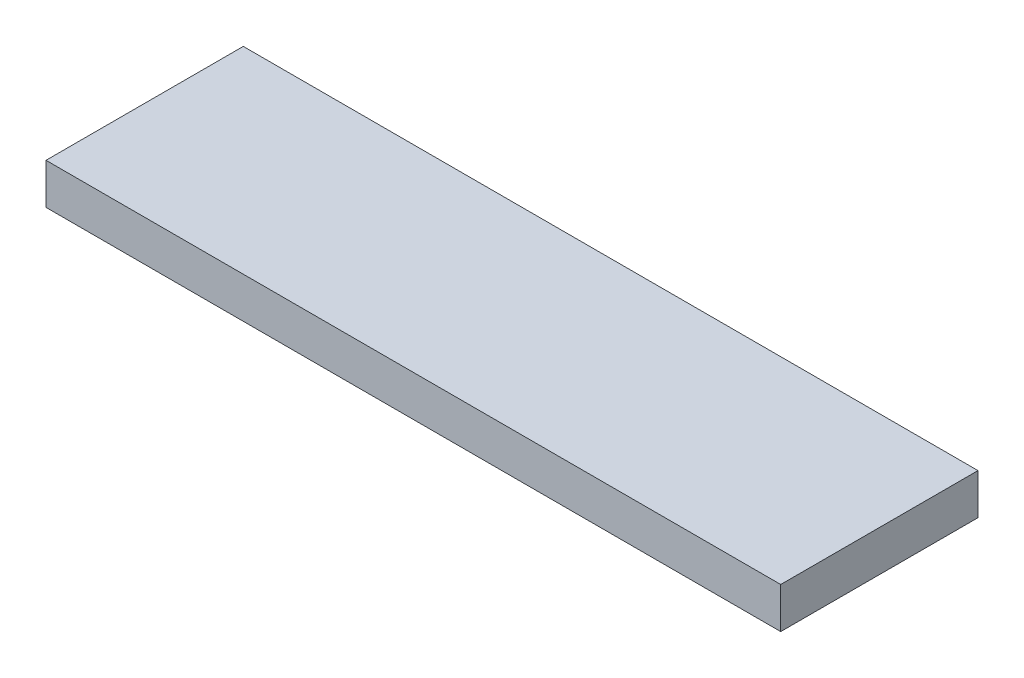
ISO-10303-21;
HEADER;
FILE_DESCRIPTION(('STEP AP214'),'2;1');
FILE_NAME('part.step','',(''),(''),'','','');
FILE_SCHEMA(('AUTOMOTIVE_DESIGN { 1 0 10303 214 1 1 1 1 }'));
ENDSEC;
DATA;
#1=APPLICATION_CONTEXT('core data for automotive mechanical design processes');
#2=APPLICATION_PROTOCOL_DEFINITION('international standard','automotive_design',2000,#1);
#3=PRODUCT_CONTEXT('',#1,'mechanical');
#4=PRODUCT('Part','Part','',(#3));
#5=PRODUCT_RELATED_PRODUCT_CATEGORY('part','',(#4));
#6=PRODUCT_DEFINITION_FORMATION('','',#4);
#7=PRODUCT_DEFINITION_CONTEXT('part definition',#1,'design');
#8=PRODUCT_DEFINITION('design','',#6,#7);
#9=PRODUCT_DEFINITION_SHAPE('','',#8);
#10=(LENGTH_UNIT() NAMED_UNIT(*) SI_UNIT(.MILLI.,.METRE.));
#11=(NAMED_UNIT(*) PLANE_ANGLE_UNIT() SI_UNIT($,.RADIAN.));
#12=(NAMED_UNIT(*) SI_UNIT($,.STERADIAN.) SOLID_ANGLE_UNIT());
#13=UNCERTAINTY_MEASURE_WITH_UNIT(LENGTH_MEASURE(1.E-05),#10,'distance_accuracy_value','');
#14=(GEOMETRIC_REPRESENTATION_CONTEXT(3) GLOBAL_UNCERTAINTY_ASSIGNED_CONTEXT((#13)) GLOBAL_UNIT_ASSIGNED_CONTEXT((#10,
#11,#12)) REPRESENTATION_CONTEXT('',''));
#15=CARTESIAN_POINT('',(0.,0.,0.));
#16=DIRECTION('',(0.,0.,1.));
#17=DIRECTION('',(1.,0.,0.));
#18=AXIS2_PLACEMENT_3D('',#15,#16,#17);
#19=CARTESIAN_POINT('',(0.,38.1,0.));
#20=DIRECTION('',(1.,0.,0.));
#21=DIRECTION('',(0.,0.,-1.));
#22=AXIS2_PLACEMENT_3D('',#19,#20,#21);
#23=PLANE('',#22);
#24=DIRECTION('',(0.,0.,1.));
#25=VECTOR('',#24,1.);
#26=CARTESIAN_POINT('',(0.,0.,0.));
#27=LINE('',#26,#25);
#28=CARTESIAN_POINT('',(0.,0.,-184.15));
#29=VERTEX_POINT('',#28);
#30=CARTESIAN_POINT('',(0.,0.,0.));
#31=VERTEX_POINT('',#30);
#32=EDGE_CURVE('E102',#29,#31,#27,.T.);
#33=ORIENTED_EDGE('',*,*,#32,.T.);
#34=DIRECTION('',(0.,-1.,0.));
#35=VECTOR('',#34,1.);
#36=CARTESIAN_POINT('',(0.,38.1,0.));
#37=LINE('',#36,#35);
#38=CARTESIAN_POINT('',(0.,38.1,0.));
#39=VERTEX_POINT('',#38);
#40=EDGE_CURVE('E11',#39,#31,#37,.T.);
#41=ORIENTED_EDGE('',*,*,#40,.F.);
#42=DIRECTION('',(0.,0.,1.));
#43=VECTOR('',#42,1.);
#44=CARTESIAN_POINT('',(0.,38.1,0.));
#45=LINE('',#44,#43);
#46=CARTESIAN_POINT('',(0.,38.1,-184.15));
#47=VERTEX_POINT('',#46);
#48=EDGE_CURVE('E90',#47,#39,#45,.T.);
#49=ORIENTED_EDGE('',*,*,#48,.F.);
#50=DIRECTION('',(0.,-1.,0.));
#51=VECTOR('',#50,1.);
#52=CARTESIAN_POINT('',(0.,38.1,-184.15));
#53=LINE('',#52,#51);
#54=EDGE_CURVE('E98',#47,#29,#53,.T.);
#55=ORIENTED_EDGE('',*,*,#54,.T.);
#56=EDGE_LOOP('',(#33,#41,#49,#55));
#57=FACE_BOUND('',#56,.T.);
#58=ADVANCED_FACE('F39',(#57),#23,.F.);
#59=CARTESIAN_POINT('',(0.,38.1,0.));
#60=DIRECTION('',(0.,0.,-1.));
#61=DIRECTION('',(-1.,0.,0.));
#62=AXIS2_PLACEMENT_3D('',#59,#60,#61);
#63=PLANE('',#62);
#64=DIRECTION('',(1.,0.,0.));
#65=VECTOR('',#64,1.);
#66=CARTESIAN_POINT('',(0.,0.,0.));
#67=LINE('',#66,#65);
#68=CARTESIAN_POINT('',(685.8,0.,0.));
#69=VERTEX_POINT('',#68);
#70=EDGE_CURVE('E94',#31,#69,#67,.T.);
#71=ORIENTED_EDGE('',*,*,#70,.T.);
#72=DIRECTION('',(0.,-1.,0.));
#73=VECTOR('',#72,1.);
#74=CARTESIAN_POINT('',(685.8,38.1,0.));
#75=LINE('',#74,#73);
#76=CARTESIAN_POINT('',(685.8,38.1,0.));
#77=VERTEX_POINT('',#76);
#78=EDGE_CURVE('E47',#77,#69,#75,.T.);
#79=ORIENTED_EDGE('',*,*,#78,.F.);
#80=DIRECTION('',(1.,0.,0.));
#81=VECTOR('',#80,1.);
#82=CARTESIAN_POINT('',(0.,38.1,0.));
#83=LINE('',#82,#81);
#84=EDGE_CURVE('E85',#39,#77,#83,.T.);
#85=ORIENTED_EDGE('',*,*,#84,.F.);
#86=ORIENTED_EDGE('',*,*,#40,.T.);
#87=EDGE_LOOP('',(#71,#79,#85,#86));
#88=FACE_BOUND('',#87,.T.);
#89=ADVANCED_FACE('F93',(#88),#63,.F.);
#90=CARTESIAN_POINT('',(685.8,38.1,0.));
#91=DIRECTION('',(-1.,0.,0.));
#92=DIRECTION('',(0.,0.,1.));
#93=AXIS2_PLACEMENT_3D('',#90,#91,#92);
#94=PLANE('',#93);
#95=DIRECTION('',(0.,0.,-1.));
#96=VECTOR('',#95,1.);
#97=CARTESIAN_POINT('',(685.8,0.,0.));
#98=LINE('',#97,#96);
#99=CARTESIAN_POINT('',(685.8,0.,-184.15));
#100=VERTEX_POINT('',#99);
#101=EDGE_CURVE('E72',#69,#100,#98,.T.);
#102=ORIENTED_EDGE('',*,*,#101,.T.);
#103=DIRECTION('',(0.,-1.,0.));
#104=VECTOR('',#103,1.);
#105=CARTESIAN_POINT('',(685.8,38.1,-184.15));
#106=LINE('',#105,#104);
#107=CARTESIAN_POINT('',(685.8,38.1,-184.15));
#108=VERTEX_POINT('',#107);
#109=EDGE_CURVE('E95',#108,#100,#106,.T.);
#110=ORIENTED_EDGE('',*,*,#109,.F.);
#111=DIRECTION('',(0.,0.,-1.));
#112=VECTOR('',#111,1.);
#113=CARTESIAN_POINT('',(685.8,38.1,0.));
#114=LINE('',#113,#112);
#115=EDGE_CURVE('E88',#77,#108,#114,.T.);
#116=ORIENTED_EDGE('',*,*,#115,.F.);
#117=ORIENTED_EDGE('',*,*,#78,.T.);
#118=EDGE_LOOP('',(#102,#110,#116,#117));
#119=FACE_BOUND('',#118,.T.);
#120=ADVANCED_FACE('F96',(#119),#94,.F.);
#121=CARTESIAN_POINT('',(0.,38.1,-184.15));
#122=DIRECTION('',(0.,0.,1.));
#123=DIRECTION('',(1.,0.,0.));
#124=AXIS2_PLACEMENT_3D('',#121,#122,#123);
#125=PLANE('',#124);
#126=DIRECTION('',(-1.,0.,0.));
#127=VECTOR('',#126,1.);
#128=CARTESIAN_POINT('',(0.,0.,-184.15));
#129=LINE('',#128,#127);
#130=EDGE_CURVE('E78',#100,#29,#129,.T.);
#131=ORIENTED_EDGE('',*,*,#130,.T.);
#132=ORIENTED_EDGE('',*,*,#54,.F.);
#133=DIRECTION('',(-1.,0.,0.));
#134=VECTOR('',#133,1.);
#135=CARTESIAN_POINT('',(0.,38.1,-184.15));
#136=LINE('',#135,#134);
#137=EDGE_CURVE('E55',#108,#47,#136,.T.);
#138=ORIENTED_EDGE('',*,*,#137,.F.);
#139=ORIENTED_EDGE('',*,*,#109,.T.);
#140=EDGE_LOOP('',(#131,#132,#138,#139));
#141=FACE_BOUND('',#140,.T.);
#142=ADVANCED_FACE('F109',(#141),#125,.F.);
#143=CARTESIAN_POINT('',(0.,38.1,0.));
#144=DIRECTION('',(0.,-1.,0.));
#145=DIRECTION('',(0.,0.,-1.));
#146=AXIS2_PLACEMENT_3D('',#143,#144,#145);
#147=PLANE('',#146);
#148=ORIENTED_EDGE('',*,*,#48,.T.);
#149=ORIENTED_EDGE('',*,*,#84,.T.);
#150=ORIENTED_EDGE('',*,*,#115,.T.);
#151=ORIENTED_EDGE('',*,*,#137,.T.);
#152=EDGE_LOOP('',(#148,#149,#150,#151));
#153=FACE_BOUND('',#152,.T.);
#154=ADVANCED_FACE('F86',(#153),#147,.F.);
#155=CARTESIAN_POINT('',(0.,0.,0.));
#156=DIRECTION('',(0.,-1.,0.));
#157=DIRECTION('',(0.,0.,-1.));
#158=AXIS2_PLACEMENT_3D('',#155,#156,#157);
#159=PLANE('',#158);
#160=ORIENTED_EDGE('',*,*,#32,.F.);
#161=ORIENTED_EDGE('',*,*,#130,.F.);
#162=ORIENTED_EDGE('',*,*,#101,.F.);
#163=ORIENTED_EDGE('',*,*,#70,.F.);
#164=EDGE_LOOP('',(#160,#161,#162,#163));
#165=FACE_BOUND('',#164,.T.);
#166=ADVANCED_FACE('F112',(#165),#159,.T.);
#167=CLOSED_SHELL('',(#58,#89,#120,#142,#154,#166));
#168=MANIFOLD_SOLID_BREP('B2',#167);
#169=ADVANCED_BREP_SHAPE_REPRESENTATION('',(#18,#168),#14);
#170=SHAPE_DEFINITION_REPRESENTATION(#9,#169);
ENDSEC;
END-ISO-10303-21;
